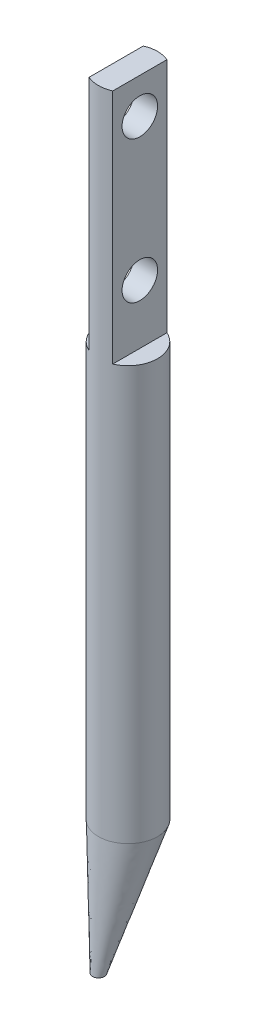
ISO-10303-21;
HEADER;
FILE_DESCRIPTION(('STEP AP214'),'2;1');
FILE_NAME('part.step','',(''),(''),'','','');
FILE_SCHEMA(('AUTOMOTIVE_DESIGN { 1 0 10303 214 1 1 1 1 }'));
ENDSEC;
DATA;
#1=APPLICATION_CONTEXT('core data for automotive mechanical design processes');
#2=APPLICATION_PROTOCOL_DEFINITION('international standard','automotive_design',2000,#1);
#3=PRODUCT_CONTEXT('',#1,'mechanical');
#4=PRODUCT('Part','Part','',(#3));
#5=PRODUCT_RELATED_PRODUCT_CATEGORY('part','',(#4));
#6=PRODUCT_DEFINITION_FORMATION('','',#4);
#7=PRODUCT_DEFINITION_CONTEXT('part definition',#1,'design');
#8=PRODUCT_DEFINITION('design','',#6,#7);
#9=PRODUCT_DEFINITION_SHAPE('','',#8);
#10=(LENGTH_UNIT() NAMED_UNIT(*) SI_UNIT(.MILLI.,.METRE.));
#11=(NAMED_UNIT(*) PLANE_ANGLE_UNIT() SI_UNIT($,.RADIAN.));
#12=(NAMED_UNIT(*) SI_UNIT($,.STERADIAN.) SOLID_ANGLE_UNIT());
#13=UNCERTAINTY_MEASURE_WITH_UNIT(LENGTH_MEASURE(1.E-05),#10,'distance_accuracy_value','');
#14=(GEOMETRIC_REPRESENTATION_CONTEXT(3) GLOBAL_UNCERTAINTY_ASSIGNED_CONTEXT((#13)) GLOBAL_UNIT_ASSIGNED_CONTEXT((#10,
#11,#12)) REPRESENTATION_CONTEXT('',''));
#15=CARTESIAN_POINT('',(0.,0.,0.));
#16=DIRECTION('',(0.,0.,1.));
#17=DIRECTION('',(1.,0.,0.));
#18=AXIS2_PLACEMENT_3D('',#15,#16,#17);
#19=CARTESIAN_POINT('',(0.,35.,0.));
#20=DIRECTION('',(0.,1.,0.));
#21=DIRECTION('',(0.,0.,1.));
#22=AXIS2_PLACEMENT_3D('',#19,#20,#21);
#23=PLANE('',#22);
#24=DIRECTION('',(0.,0.,-1.));
#25=VECTOR('',#24,1.);
#26=CARTESIAN_POINT('',(1.,35.,-2.29128784747792));
#27=LINE('',#26,#25);
#28=CARTESIAN_POINT('',(1.,35.,2.29128784747792));
#29=VERTEX_POINT('',#28);
#30=CARTESIAN_POINT('',(1.,35.,-2.29128784747792));
#31=VERTEX_POINT('',#30);
#32=EDGE_CURVE('E115',#29,#31,#27,.T.);
#33=ORIENTED_EDGE('',*,*,#32,.F.);
#34=CARTESIAN_POINT('',(0.,35.,0.));
#35=DIRECTION('',(0.,1.,0.));
#36=DIRECTION('',(0.,0.,1.));
#37=AXIS2_PLACEMENT_3D('',#34,#35,#36);
#38=CIRCLE('',#37,2.5);
#39=EDGE_CURVE('E12',#29,#31,#38,.T.);
#40=ORIENTED_EDGE('',*,*,#39,.T.);
#41=EDGE_LOOP('',(#33,#40));
#42=FACE_BOUND('',#41,.T.);
#43=ADVANCED_FACE('F54',(#42),#23,.T.);
#44=CARTESIAN_POINT('',(0.,35.,0.));
#45=DIRECTION('',(0.,-1.,0.));
#46=DIRECTION('',(0.,0.,-1.));
#47=AXIS2_PLACEMENT_3D('',#44,#45,#46);
#48=CYLINDRICAL_SURFACE('',#47,2.5);
#49=ORIENTED_EDGE('',*,*,#39,.F.);
#50=DIRECTION('',(0.,-1.,0.));
#51=VECTOR('',#50,1.);
#52=CARTESIAN_POINT('',(1.,55.,2.29128784747792));
#53=LINE('',#52,#51);
#54=CARTESIAN_POINT('',(1.,55.,2.29128784747792));
#55=VERTEX_POINT('',#54);
#56=EDGE_CURVE('E124',#55,#29,#53,.T.);
#57=ORIENTED_EDGE('',*,*,#56,.F.);
#58=CARTESIAN_POINT('',(0.,55.,0.));
#59=DIRECTION('',(0.,1.,0.));
#60=DIRECTION('',(0.,0.,1.));
#61=AXIS2_PLACEMENT_3D('',#58,#59,#60);
#62=CIRCLE('',#61,2.5);
#63=CARTESIAN_POINT('',(-1.,55.,2.29128784747792));
#64=VERTEX_POINT('',#63);
#65=EDGE_CURVE('E105',#64,#55,#62,.T.);
#66=ORIENTED_EDGE('',*,*,#65,.F.);
#67=DIRECTION('',(0.,-1.,0.));
#68=VECTOR('',#67,1.);
#69=CARTESIAN_POINT('',(-1.,55.,2.29128784747792));
#70=LINE('',#69,#68);
#71=CARTESIAN_POINT('',(-1.,35.,2.29128784747792));
#72=VERTEX_POINT('',#71);
#73=EDGE_CURVE('E102',#64,#72,#70,.T.);
#74=ORIENTED_EDGE('',*,*,#73,.T.);
#75=CARTESIAN_POINT('',(-1.,35.,-2.29128784747792));
#76=VERTEX_POINT('',#75);
#77=EDGE_CURVE('E64',#76,#72,#38,.T.);
#78=ORIENTED_EDGE('',*,*,#77,.F.);
#79=DIRECTION('',(0.,-1.,0.));
#80=VECTOR('',#79,1.);
#81=CARTESIAN_POINT('',(-1.,55.,-2.29128784747792));
#82=LINE('',#81,#80);
#83=CARTESIAN_POINT('',(-1.,55.,-2.29128784747792));
#84=VERTEX_POINT('',#83);
#85=EDGE_CURVE('E100',#84,#76,#82,.T.);
#86=ORIENTED_EDGE('',*,*,#85,.F.);
#87=CARTESIAN_POINT('',(0.,55.,0.));
#88=DIRECTION('',(0.,1.,0.));
#89=DIRECTION('',(0.,0.,1.));
#90=AXIS2_PLACEMENT_3D('',#87,#88,#89);
#91=CIRCLE('',#90,2.5);
#92=CARTESIAN_POINT('',(1.,55.,-2.29128784747792));
#93=VERTEX_POINT('',#92);
#94=EDGE_CURVE('E106',#93,#84,#91,.T.);
#95=ORIENTED_EDGE('',*,*,#94,.F.);
#96=DIRECTION('',(0.,-1.,0.));
#97=VECTOR('',#96,1.);
#98=CARTESIAN_POINT('',(1.,55.,-2.29128784747792));
#99=LINE('',#98,#97);
#100=EDGE_CURVE('E205',#93,#31,#99,.T.);
#101=ORIENTED_EDGE('',*,*,#100,.T.);
#102=EDGE_LOOP('',(#49,#57,#66,#74,#78,#86,#95,#101));
#103=FACE_BOUND('',#102,.T.);
#104=CARTESIAN_POINT('',(0.,0.,0.));
#105=DIRECTION('',(0.,1.,0.));
#106=DIRECTION('',(0.,0.,1.));
#107=AXIS2_PLACEMENT_3D('',#104,#105,#106);
#108=CIRCLE('',#107,2.5);
#109=CARTESIAN_POINT('',(0.230578892877983,0.,-2.4893439646138));
#110=VERTEX_POINT('',#109);
#111=EDGE_CURVE('E121',#110,#110,#108,.F.);
#112=ORIENTED_EDGE('',*,*,#111,.F.);
#113=EDGE_LOOP('',(#112));
#114=FACE_BOUND('',#113,.T.);
#115=ADVANCED_FACE('F56',(#103,#114),#48,.T.);
#116=DIRECTION('',(0.,0.,1.));
#117=VECTOR('',#116,1.);
#118=CARTESIAN_POINT('',(-1.,35.,-2.29128784747792));
#119=LINE('',#118,#117);
#120=EDGE_CURVE('E71',#76,#72,#119,.T.);
#121=ORIENTED_EDGE('',*,*,#120,.F.);
#122=ORIENTED_EDGE('',*,*,#77,.T.);
#123=EDGE_LOOP('',(#121,#122));
#124=FACE_BOUND('',#123,.T.);
#125=ADVANCED_FACE('F151',(#124),#23,.T.);
#126=CARTESIAN_POINT('',(0.,-10.,2.5));
#127=DIRECTION('',(0.,-1.,0.));
#128=DIRECTION('',(0.,0.,-1.));
#129=AXIS2_PLACEMENT_3D('',#126,#127,#128);
#130=PLANE('',#129);
#131=CARTESIAN_POINT('',(0.,-10.,2.5));
#132=DIRECTION('',(0.,-1.,0.));
#133=DIRECTION('',(0.,0.,-1.));
#134=AXIS2_PLACEMENT_3D('',#131,#132,#133);
#135=CIRCLE('',#134,0.5);
#136=CARTESIAN_POINT('',(0.,-10.,2.));
#137=VERTEX_POINT('',#136);
#138=EDGE_CURVE('E118',#137,#137,#135,.T.);
#139=ORIENTED_EDGE('',*,*,#138,.T.);
#140=EDGE_LOOP('',(#139));
#141=FACE_BOUND('',#140,.T.);
#142=ADVANCED_FACE('F148',(#141),#130,.T.);
#143=CARTESIAN_POINT('',(0.230578892877983,0.,-2.4893439646138));
#144=CARTESIAN_POINT('',(0.,-10.,2.));
#145=CARTESIAN_POINT('',(0.438024223262467,0.,-2.47012905687397));
#146=CARTESIAN_POINT('',(0.0416666666666667,-10.,2.));
#147=CARTESIAN_POINT('',(0.670349848212232,0.,-2.42316780106392));
#148=CARTESIAN_POINT('',(0.0888,-10.,2.00506666666667));
#149=CARTESIAN_POINT('',(1.16639424629723,0.,-2.22724843098291));
#150=CARTESIAN_POINT('',(0.1912,-10.,2.03493333333333));
#151=CARTESIAN_POINT('',(1.43098578160877,0.,-2.07687043504034));
#152=CARTESIAN_POINT('',(0.246666666666667,-10.,2.06));
#153=CARTESIAN_POINT('',(1.92515320453257,0.,-1.62938523688816));
#154=CARTESIAN_POINT('',(0.353333333333333,-10.,2.14));
#155=CARTESIAN_POINT('',(2.1531439153793,0.,-1.32957071442748));
#156=CARTESIAN_POINT('',(0.404267589388697,-10.,2.19550173010381));
#157=CARTESIAN_POINT('',(2.38090956691896,0.,-0.787220671351615));
#158=CARTESIAN_POINT('',(0.459630911188004,-10.,2.29930795847751));
#159=CARTESIAN_POINT('',(2.43756593452779,0.,-0.591903619999725));
#160=CARTESIAN_POINT('',(0.474336793540946,-10.,2.33729815455594));
#161=CARTESIAN_POINT('',(2.50144735952505,0.,-0.186651247154364));
#162=CARTESIAN_POINT('',(0.494521337946944,-10.,2.41681084198385));
#163=CARTESIAN_POINT('',(2.50855887235364,0.,0.0231335624935001));
#164=CARTESIAN_POINT('',(0.5,-10.,2.45833333333333));
#165=CARTESIAN_POINT('',(2.47012905687397,0.,0.438024223262467));
#166=CARTESIAN_POINT('',(0.5,-10.,2.54166666666667));
#167=CARTESIAN_POINT('',(2.42460592019435,0.,0.642933676437644));
#168=CARTESIAN_POINT('',(0.494521337946943,-10.,2.58318915801615));
#169=CARTESIAN_POINT('',(2.28737584856324,0.,1.02955782156647));
#170=CARTESIAN_POINT('',(0.474336793540946,-10.,2.66270184544406));
#171=CARTESIAN_POINT('',(2.19580817194425,0.,1.21114541788853));
#172=CARTESIAN_POINT('',(0.459630911188005,-10.,2.70069204152249));
#173=CARTESIAN_POINT('',(1.87230041955559,0.,1.70243300717826));
#174=CARTESIAN_POINT('',(0.404267589388697,-10.,2.80449826989619));
#175=CARTESIAN_POINT('',(1.59311959878827,0.,1.95527007215571));
#176=CARTESIAN_POINT('',(0.353333333333333,-10.,2.86));
#177=CARTESIAN_POINT('',(1.02516693014352,0.,2.30437494267995));
#178=CARTESIAN_POINT('',(0.246666666666667,-10.,2.94));
#179=CARTESIAN_POINT('',(0.73745601783941,0.,2.40359516825599));
#180=CARTESIAN_POINT('',(0.1912,-10.,2.96506666666667));
#181=CARTESIAN_POINT('',(0.213865128018591,0.,2.50506942381418));
#182=CARTESIAN_POINT('',(0.0888000000000001,-10.,2.99493333333333));
#183=CARTESIAN_POINT('',(-0.0231335624935004,0.,2.50855887235364));
#184=CARTESIAN_POINT('',(0.0416666666666667,-10.,3.));
#185=CARTESIAN_POINT('',(-0.438024223262467,0.,2.47012905687397));
#186=CARTESIAN_POINT('',(-0.0416666666666666,-10.,3.));
#187=CARTESIAN_POINT('',(-0.670349848212232,0.,2.42316780106392));
#188=CARTESIAN_POINT('',(-0.0888,-10.,2.99493333333333));
#189=CARTESIAN_POINT('',(-1.16639424629723,0.,2.22724843098291));
#190=CARTESIAN_POINT('',(-0.1912,-10.,2.96506666666667));
#191=CARTESIAN_POINT('',(-1.43098578160877,0.,2.07687043504034));
#192=CARTESIAN_POINT('',(-0.246666666666667,-10.,2.94));
#193=CARTESIAN_POINT('',(-1.92515320453257,0.,1.62938523688816));
#194=CARTESIAN_POINT('',(-0.353333333333333,-10.,2.86));
#195=CARTESIAN_POINT('',(-2.1531439153793,0.,1.32957071442748));
#196=CARTESIAN_POINT('',(-0.404267589388697,-10.,2.80449826989619));
#197=CARTESIAN_POINT('',(-2.38090956691896,0.,0.787220671351616));
#198=CARTESIAN_POINT('',(-0.459630911188005,-10.,2.70069204152249));
#199=CARTESIAN_POINT('',(-2.43756593452779,0.,0.591903619999726));
#200=CARTESIAN_POINT('',(-0.474336793540946,-10.,2.66270184544406));
#201=CARTESIAN_POINT('',(-2.50144735952505,0.,0.186651247154364));
#202=CARTESIAN_POINT('',(-0.494521337946944,-10.,2.58318915801615));
#203=CARTESIAN_POINT('',(-2.50855887235364,0.,-0.0231335624935005));
#204=CARTESIAN_POINT('',(-0.5,-10.,2.54166666666667));
#205=CARTESIAN_POINT('',(-2.47012905687397,0.,-0.438024223262467));
#206=CARTESIAN_POINT('',(-0.5,-10.,2.45833333333333));
#207=CARTESIAN_POINT('',(-2.42460592019435,0.,-0.642933676437645));
#208=CARTESIAN_POINT('',(-0.494521337946944,-10.,2.41681084198385));
#209=CARTESIAN_POINT('',(-2.28737584856324,0.,-1.02955782156647));
#210=CARTESIAN_POINT('',(-0.474336793540946,-10.,2.33729815455594));
#211=CARTESIAN_POINT('',(-2.19580817194425,0.,-1.21114541788853));
#212=CARTESIAN_POINT('',(-0.459630911188005,-10.,2.29930795847751));
#213=CARTESIAN_POINT('',(-1.8723004195556,0.,-1.70243300717826));
#214=CARTESIAN_POINT('',(-0.404267589388697,-10.,2.19550173010381));
#215=CARTESIAN_POINT('',(-1.59311959878827,0.,-1.95527007215571));
#216=CARTESIAN_POINT('',(-0.353333333333333,-10.,2.14));
#217=CARTESIAN_POINT('',(-1.02516693014352,0.,-2.30437494267995));
#218=CARTESIAN_POINT('',(-0.246666666666667,-10.,2.06));
#219=CARTESIAN_POINT('',(-0.73745601783941,0.,-2.40359516825599));
#220=CARTESIAN_POINT('',(-0.1912,-10.,2.03493333333333));
#221=CARTESIAN_POINT('',(-0.213865128018593,0.,-2.50506942381418));
#222=CARTESIAN_POINT('',(-0.0887999999999999,-10.,2.00506666666667));
#223=CARTESIAN_POINT('',(0.0231335624934999,0.,-2.50855887235364));
#224=CARTESIAN_POINT('',(-0.0416666666666666,-10.,2.));
#225=CARTESIAN_POINT('',(0.230578892877983,0.,-2.4893439646138));
#226=CARTESIAN_POINT('',(0.,-10.,2.));
#227=B_SPLINE_SURFACE_WITH_KNOTS('',3,1,((#143,#144),(#145,#146),(#147,#148),(#149,#150),(#151,
#152),(#153,#154),(#155,#156),(#157,#158),(#159,#160),(#161,#162),(#163,#164),(#165,#166),(#167,
#168),(#169,#170),(#171,#172),(#173,#174),(#175,#176),(#177,#178),(#179,#180),(#181,#182),(#183,
#184),(#185,#186),(#187,#188),(#189,#190),(#191,#192),(#193,#194),(#195,#196),(#197,#198),(#199,
#200),(#201,#202),(#203,#204),(#205,#206),(#207,#208),(#209,#210),(#211,#212),(#213,#214),(#215,
#216),(#217,#218),(#219,#220),(#221,#222),(#223,#224),(#225,#226)),.UNSPECIFIED.,.T.,.F.,.F.,(4,
2,2,2,2,2,2,2,2,2,2,2,2,2,2,2,2,2,2,2,4),(2,2),(0.,0.0625,0.125,0.1875,0.21875,0.25,0.28125,
0.3125,0.375,0.4375,0.5,0.5625,0.625,0.6875,0.71875,0.75,0.78125,0.8125,0.875,0.9375,1.),(0.,
1.),.UNSPECIFIED.);
#228=CARTESIAN_POINT('',(0.230578892877983,0.,-2.4893439646138));
#229=CARTESIAN_POINT('',(0.228177029410504,-0.104166666666666,-2.44257996498241));
#230=CARTESIAN_POINT('',(0.225775165943026,-0.208333333333333,-2.39581596535102));
#231=CARTESIAN_POINT('',(0.220971439008067,-0.416666666666667,-2.30228796608823));
#232=CARTESIAN_POINT('',(0.218569575540588,-0.520833333333333,-2.25552396645683));
#233=CARTESIAN_POINT('',(0.21376584860563,-0.729166666666667,-2.16199596719405));
#234=CARTESIAN_POINT('',(0.211363985138152,-0.833333333333333,-2.11523196756265));
#235=CARTESIAN_POINT('',(0.206560258203194,-1.04166666666667,-2.02170396829987));
#236=CARTESIAN_POINT('',(0.204158394735715,-1.14583333333333,-1.97493996866847));
#237=CARTESIAN_POINT('',(0.199354667800757,-1.35416666666667,-1.88141196940568));
#238=CARTESIAN_POINT('',(0.196952804333278,-1.45833333333333,-1.83464796977429));
#239=CARTESIAN_POINT('',(0.19214907739832,-1.66666666666667,-1.7411199705115));
#240=CARTESIAN_POINT('',(0.189747213930841,-1.77083333333333,-1.69435597088011));
#241=CARTESIAN_POINT('',(0.184943486995883,-1.97916666666667,-1.60082797161732));
#242=CARTESIAN_POINT('',(0.182541623528404,-2.08333333333333,-1.55406397198593));
#243=CARTESIAN_POINT('',(0.177737896593446,-2.29166666666667,-1.46053597272314));
#244=CARTESIAN_POINT('',(0.175336033125967,-2.39583333333333,-1.41377197309175));
#245=CARTESIAN_POINT('',(0.170532306191009,-2.60416666666667,-1.32024397382896));
#246=CARTESIAN_POINT('',(0.16813044272353,-2.70833333333333,-1.27347997419756));
#247=CARTESIAN_POINT('',(0.163326715788572,-2.91666666666667,-1.17995197493478));
#248=CARTESIAN_POINT('',(0.160924852321093,-3.02083333333333,-1.13318797530338));
#249=CARTESIAN_POINT('',(0.156121125386135,-3.22916666666667,-1.0396599760406));
#250=CARTESIAN_POINT('',(0.153719261918656,-3.33333333333333,-0.992895976409202));
#251=CARTESIAN_POINT('',(0.148915534983698,-3.54166666666667,-0.899367977146415));
#252=CARTESIAN_POINT('',(0.146513671516219,-3.64583333333333,-0.852603977515021));
#253=CARTESIAN_POINT('',(0.141709944581261,-3.85416666666667,-0.759075978252233));
#254=CARTESIAN_POINT('',(0.139308081113782,-3.95833333333333,-0.712311978620839));
#255=CARTESIAN_POINT('',(0.134504354178824,-4.16666666666667,-0.618783979358052));
#256=CARTESIAN_POINT('',(0.132102490711345,-4.27083333333333,-0.572019979726658));
#257=CARTESIAN_POINT('',(0.127298763776387,-4.47916666666667,-0.478491980463871));
#258=CARTESIAN_POINT('',(0.124896900308908,-4.58333333333333,-0.431727980832477));
#259=CARTESIAN_POINT('',(0.12009317337395,-4.79166666666667,-0.338199981569689));
#260=CARTESIAN_POINT('',(0.117691309906471,-4.89583333333333,-0.291435981938295));
#261=CARTESIAN_POINT('',(0.112887582971513,-5.10416666666667,-0.197907982675508));
#262=CARTESIAN_POINT('',(0.110485719504034,-5.20833333333333,-0.151143983044114));
#263=CARTESIAN_POINT('',(0.105681992569076,-5.41666666666667,-0.0576159837813263));
#264=CARTESIAN_POINT('',(0.103280129101597,-5.52083333333333,-0.0108519841499324));
#265=CARTESIAN_POINT('',(0.0984764021666388,-5.72916666666667,0.0826760151128551));
#266=CARTESIAN_POINT('',(0.0960745386991598,-5.83333333333333,0.129440014744249));
#267=CARTESIAN_POINT('',(0.0912708117642018,-6.04166666666667,0.222968014007036));
#268=CARTESIAN_POINT('',(0.0888689482967228,-6.14583333333333,0.26973201363843));
#269=CARTESIAN_POINT('',(0.0840652213617648,-6.35416666666667,0.363260012901218));
#270=CARTESIAN_POINT('',(0.0816633578942858,-6.45833333333333,0.410024012532612));
#271=CARTESIAN_POINT('',(0.0768596309593278,-6.66666666666667,0.503552011795399));
#272=CARTESIAN_POINT('',(0.0744577674918488,-6.77083333333333,0.550316011426793));
#273=CARTESIAN_POINT('',(0.0696540405568909,-6.97916666666667,0.643844010689581));
#274=CARTESIAN_POINT('',(0.0672521770894119,-7.08333333333333,0.690608010320974));
#275=CARTESIAN_POINT('',(0.0624484501544539,-7.29166666666667,0.784136009583762));
#276=CARTESIAN_POINT('',(0.0600465866869749,-7.39583333333333,0.830900009215155));
#277=CARTESIAN_POINT('',(0.0552428597520169,-7.60416666666667,0.924428008477943));
#278=CARTESIAN_POINT('',(0.0528409962845379,-7.70833333333333,0.971192008109337));
#279=CARTESIAN_POINT('',(0.0480372693495799,-7.91666666666667,1.06472000737212));
#280=CARTESIAN_POINT('',(0.0456354058821009,-8.02083333333333,1.11148400700352));
#281=CARTESIAN_POINT('',(0.0408316789471429,-8.22916666666667,1.20501200626631));
#282=CARTESIAN_POINT('',(0.038429815479664,-8.33333333333333,1.2517760058977));
#283=CARTESIAN_POINT('',(0.033626088544706,-8.54166666666667,1.34530400516049));
#284=CARTESIAN_POINT('',(0.031224225077227,-8.64583333333333,1.39206800479188));
#285=CARTESIAN_POINT('',(0.026420498142269,-8.85416666666666,1.48559600405467));
#286=CARTESIAN_POINT('',(0.02401863467479,-8.95833333333333,1.53236000368606));
#287=CARTESIAN_POINT('',(0.019214907739832,-9.16666666666666,1.62588800294885));
#288=CARTESIAN_POINT('',(0.016813044272353,-9.27083333333333,1.67265200258024));
#289=CARTESIAN_POINT('',(0.012009317337395,-9.47916666666667,1.76618000184303));
#290=CARTESIAN_POINT('',(0.00960745386991602,-9.58333333333333,1.81294400147443));
#291=CARTESIAN_POINT('',(0.00480372693495804,-9.79166666666667,1.90647200073721));
#292=CARTESIAN_POINT('',(0.00240186346747905,-9.89583333333333,1.95323600036861));
#293=CARTESIAN_POINT('',(0.,-10.,2.));
#294=B_SPLINE_CURVE_WITH_KNOTS('',3,(#228,#229,#230,#231,#232,#233,#234,#235,#236,#237,#238,
#239,#240,#241,#242,#243,#244,#245,#246,#247,#248,#249,#250,#251,#252,#253,#254,#255,#256,#257,
#258,#259,#260,#261,#262,#263,#264,#265,#266,#267,#268,#269,#270,#271,#272,#273,#274,#275,#276,
#277,#278,#279,#280,#281,#282,#283,#284,#285,#286,#287,#288,#289,#290,#291,#292,#293),
.UNSPECIFIED.,.F.,.F.,(4,2,2,2,2,2,2,2,2,2,2,2,2,2,2,2,2,2,2,2,2,2,2,2,2,2,2,2,2,2,2,2,4),(0.,
0.3426222635597,0.685244527119401,1.0278667906791,1.3704890542388,1.7131113177985,
2.0557335813582,2.3983558449179,2.7409781084776,3.0836003720373,3.426222635597,3.7688448991567,
4.1114671627164,4.4540894262761,4.7967116898358,5.1393339533955,5.4819562169552,5.8245784805149,
6.1672007440746,6.5098230076343,6.852445271194,7.1950675347537,7.53768979831341,
7.88031206187311,8.2229343254328,8.5655565889925,8.9081788525522,9.25080111611191,
9.59342337967161,9.93604564323131,10.278667906791,10.6212901703507,10.9639124339104),.UNSPECIFIED.);
#295=EDGE_CURVE('BSEAM137',#110,#137,#294,.T.);
#296=ORIENTED_EDGE('',*,*,#111,.T.);
#297=ORIENTED_EDGE('',*,*,#138,.F.);
#298=ORIENTED_EDGE('',*,*,#295,.T.);
#299=ORIENTED_EDGE('',*,*,#295,.F.);
#300=EDGE_LOOP('',(#296,#298,#297,#299));
#301=FACE_BOUND('',#300,.T.);
#302=ADVANCED_FACE('F137',(#301),#227,.T.);
#303=CARTESIAN_POINT('',(-1.,55.,-2.29128784747792));
#304=DIRECTION('',(1.,0.,0.));
#305=DIRECTION('',(0.,0.,-1.));
#306=AXIS2_PLACEMENT_3D('',#303,#304,#305);
#307=PLANE('',#306);
#308=CARTESIAN_POINT('',(-1.,52.,0.));
#309=DIRECTION('',(1.,0.,0.));
#310=DIRECTION('',(0.,0.,-1.));
#311=AXIS2_PLACEMENT_3D('',#308,#309,#310);
#312=CIRCLE('',#311,1.5);
#313=CARTESIAN_POINT('',(-1.,52.,-1.5));
#314=VERTEX_POINT('',#313);
#315=EDGE_CURVE('E199',#314,#314,#312,.T.);
#316=ORIENTED_EDGE('',*,*,#315,.T.);
#317=EDGE_LOOP('',(#316));
#318=FACE_BOUND('',#317,.T.);
#319=CARTESIAN_POINT('',(-1.,40.,0.));
#320=DIRECTION('',(1.,0.,0.));
#321=DIRECTION('',(0.,0.,-1.));
#322=AXIS2_PLACEMENT_3D('',#319,#320,#321);
#323=CIRCLE('',#322,1.5);
#324=CARTESIAN_POINT('',(-1.,40.,-1.5));
#325=VERTEX_POINT('',#324);
#326=EDGE_CURVE('E191',#325,#325,#323,.T.);
#327=ORIENTED_EDGE('',*,*,#326,.T.);
#328=EDGE_LOOP('',(#327));
#329=FACE_BOUND('',#328,.T.);
#330=ORIENTED_EDGE('',*,*,#120,.T.);
#331=ORIENTED_EDGE('',*,*,#73,.F.);
#332=DIRECTION('',(0.,0.,1.));
#333=VECTOR('',#332,1.);
#334=CARTESIAN_POINT('',(-1.,55.,-2.29128784747792));
#335=LINE('',#334,#333);
#336=EDGE_CURVE('E96',#84,#64,#335,.T.);
#337=ORIENTED_EDGE('',*,*,#336,.F.);
#338=ORIENTED_EDGE('',*,*,#85,.T.);
#339=EDGE_LOOP('',(#330,#331,#337,#338));
#340=FACE_BOUND('',#339,.T.);
#341=ADVANCED_FACE('F98',(#318,#329,#340),#307,.F.);
#342=CARTESIAN_POINT('',(1.,55.,-2.29128784747792));
#343=DIRECTION('',(-1.,0.,0.));
#344=DIRECTION('',(0.,0.,1.));
#345=AXIS2_PLACEMENT_3D('',#342,#343,#344);
#346=PLANE('',#345);
#347=CARTESIAN_POINT('',(1.,52.,0.));
#348=DIRECTION('',(-1.,0.,0.));
#349=DIRECTION('',(0.,0.,1.));
#350=AXIS2_PLACEMENT_3D('',#347,#348,#349);
#351=CIRCLE('',#350,1.5);
#352=CARTESIAN_POINT('',(1.,52.,1.5));
#353=VERTEX_POINT('',#352);
#354=EDGE_CURVE('E59',#353,#353,#351,.T.);
#355=ORIENTED_EDGE('',*,*,#354,.T.);
#356=EDGE_LOOP('',(#355));
#357=FACE_BOUND('',#356,.T.);
#358=CARTESIAN_POINT('',(1.,40.,0.));
#359=DIRECTION('',(-1.,0.,0.));
#360=DIRECTION('',(0.,0.,1.));
#361=AXIS2_PLACEMENT_3D('',#358,#359,#360);
#362=CIRCLE('',#361,1.5);
#363=CARTESIAN_POINT('',(1.,40.,1.5));
#364=VERTEX_POINT('',#363);
#365=EDGE_CURVE('E184',#364,#364,#362,.T.);
#366=ORIENTED_EDGE('',*,*,#365,.T.);
#367=EDGE_LOOP('',(#366));
#368=FACE_BOUND('',#367,.T.);
#369=ORIENTED_EDGE('',*,*,#32,.T.);
#370=ORIENTED_EDGE('',*,*,#100,.F.);
#371=DIRECTION('',(0.,0.,-1.));
#372=VECTOR('',#371,1.);
#373=CARTESIAN_POINT('',(1.,55.,-2.29128784747792));
#374=LINE('',#373,#372);
#375=EDGE_CURVE('E111',#55,#93,#374,.T.);
#376=ORIENTED_EDGE('',*,*,#375,.F.);
#377=ORIENTED_EDGE('',*,*,#56,.T.);
#378=EDGE_LOOP('',(#369,#370,#376,#377));
#379=FACE_BOUND('',#378,.T.);
#380=ADVANCED_FACE('F212',(#357,#368,#379),#346,.F.);
#381=CARTESIAN_POINT('',(0.,55.,0.));
#382=DIRECTION('',(0.,1.,0.));
#383=DIRECTION('',(0.,0.,1.));
#384=AXIS2_PLACEMENT_3D('',#381,#382,#383);
#385=PLANE('',#384);
#386=ORIENTED_EDGE('',*,*,#94,.T.);
#387=ORIENTED_EDGE('',*,*,#336,.T.);
#388=ORIENTED_EDGE('',*,*,#65,.T.);
#389=ORIENTED_EDGE('',*,*,#375,.T.);
#390=EDGE_LOOP('',(#386,#387,#388,#389));
#391=FACE_BOUND('',#390,.T.);
#392=ADVANCED_FACE('F109',(#391),#385,.T.);
#393=CARTESIAN_POINT('',(2.55803679899192,40.,0.));
#394=DIRECTION('',(-1.,0.,0.));
#395=DIRECTION('',(0.,0.,1.));
#396=AXIS2_PLACEMENT_3D('',#393,#394,#395);
#397=CYLINDRICAL_SURFACE('',#396,1.5);
#398=ORIENTED_EDGE('',*,*,#365,.F.);
#399=EDGE_LOOP('',(#398));
#400=FACE_BOUND('',#399,.T.);
#401=ORIENTED_EDGE('',*,*,#326,.F.);
#402=EDGE_LOOP('',(#401));
#403=FACE_BOUND('',#402,.T.);
#404=ADVANCED_FACE('F248',(#400,#403),#397,.F.);
#405=CARTESIAN_POINT('',(2.55803679899192,52.,0.));
#406=DIRECTION('',(-1.,0.,0.));
#407=DIRECTION('',(0.,0.,1.));
#408=AXIS2_PLACEMENT_3D('',#405,#406,#407);
#409=CYLINDRICAL_SURFACE('',#408,1.5);
#410=ORIENTED_EDGE('',*,*,#354,.F.);
#411=EDGE_LOOP('',(#410));
#412=FACE_BOUND('',#411,.T.);
#413=ORIENTED_EDGE('',*,*,#315,.F.);
#414=EDGE_LOOP('',(#413));
#415=FACE_BOUND('',#414,.T.);
#416=ADVANCED_FACE('F254',(#412,#415),#409,.F.);
#417=CLOSED_SHELL('',(#43,#115,#125,#142,#302,#341,#380,#392,#404,#416));
#418=MANIFOLD_SOLID_BREP('B2',#417);
#419=ADVANCED_BREP_SHAPE_REPRESENTATION('',(#18,#418),#14);
#420=SHAPE_DEFINITION_REPRESENTATION(#9,#419);
ENDSEC;
END-ISO-10303-21;
